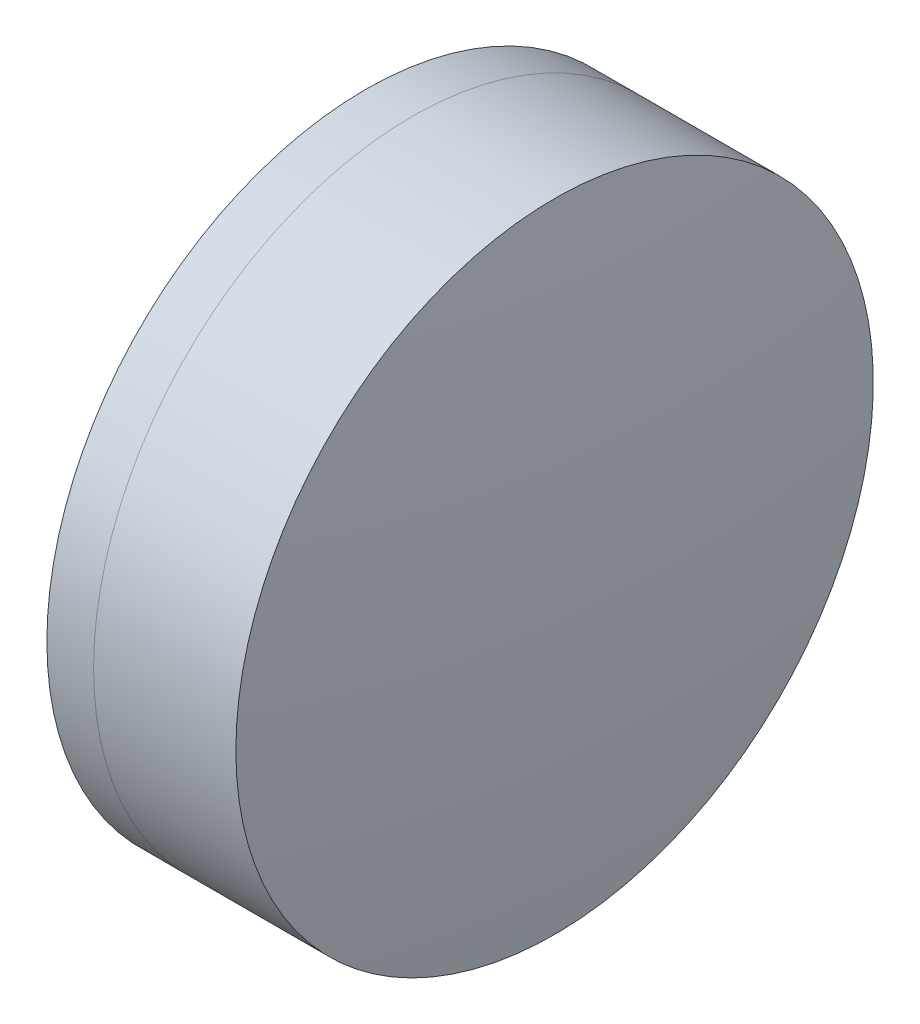
ISO-10303-21;
HEADER;
FILE_DESCRIPTION(('STEP AP214'),'2;1');
FILE_NAME('part.step','',(''),(''),'','','');
FILE_SCHEMA(('AUTOMOTIVE_DESIGN { 1 0 10303 214 1 1 1 1 }'));
ENDSEC;
DATA;
#1=APPLICATION_CONTEXT('core data for automotive mechanical design processes');
#2=APPLICATION_PROTOCOL_DEFINITION('international standard','automotive_design',2000,#1);
#3=PRODUCT_CONTEXT('',#1,'mechanical');
#4=PRODUCT('Part','Part','',(#3));
#5=PRODUCT_RELATED_PRODUCT_CATEGORY('part','',(#4));
#6=PRODUCT_DEFINITION_FORMATION('','',#4);
#7=PRODUCT_DEFINITION_CONTEXT('part definition',#1,'design');
#8=PRODUCT_DEFINITION('design','',#6,#7);
#9=PRODUCT_DEFINITION_SHAPE('','',#8);
#10=(LENGTH_UNIT() NAMED_UNIT(*) SI_UNIT(.MILLI.,.METRE.));
#11=(NAMED_UNIT(*) PLANE_ANGLE_UNIT() SI_UNIT($,.RADIAN.));
#12=(NAMED_UNIT(*) SI_UNIT($,.STERADIAN.) SOLID_ANGLE_UNIT());
#13=UNCERTAINTY_MEASURE_WITH_UNIT(LENGTH_MEASURE(1.E-05),#10,'distance_accuracy_value','');
#14=(GEOMETRIC_REPRESENTATION_CONTEXT(3) GLOBAL_UNCERTAINTY_ASSIGNED_CONTEXT((#13)) GLOBAL_UNIT_ASSIGNED_CONTEXT((#10,
#11,#12)) REPRESENTATION_CONTEXT('',''));
#15=CARTESIAN_POINT('',(0.,0.,0.));
#16=DIRECTION('',(0.,0.,1.));
#17=DIRECTION('',(1.,0.,0.));
#18=AXIS2_PLACEMENT_3D('',#15,#16,#17);
#19=CARTESIAN_POINT('',(264.478986554565,0.,0.));
#20=DIRECTION('',(-1.,0.,0.));
#21=DIRECTION('',(0.,0.,1.));
#22=AXIS2_PLACEMENT_3D('',#19,#20,#21);
#23=SPHERICAL_SURFACE('',#22,18.62);
#24=CARTESIAN_POINT('',(278.095682188969,0.,0.));
#25=DIRECTION('',(-1.,0.,0.));
#26=DIRECTION('',(0.,0.,1.));
#27=AXIS2_PLACEMENT_3D('',#24,#25,#26);
#28=CIRCLE('',#27,12.7);
#29=CARTESIAN_POINT('',(278.095682188969,0.,12.7));
#30=VERTEX_POINT('',#29);
#31=EDGE_CURVE('E11',#30,#30,#28,.T.);
#32=ORIENTED_EDGE('',*,*,#31,.T.);
#33=EDGE_LOOP('',(#32));
#34=FACE_BOUND('',#33,.T.);
#35=ADVANCED_FACE('F43',(#34),#23,.F.);
#36=CARTESIAN_POINT('',(-0.551919992657797,0.,0.));
#37=DIRECTION('',(-1.,0.,0.));
#38=DIRECTION('',(0.,0.,1.));
#39=AXIS2_PLACEMENT_3D('',#36,#37,#38);
#40=CYLINDRICAL_SURFACE('',#39,12.7);
#41=CARTESIAN_POINT('',(283.766338757952,0.,0.));
#42=DIRECTION('',(-1.,0.,0.));
#43=DIRECTION('',(0.,0.,1.));
#44=AXIS2_PLACEMENT_3D('',#41,#42,#43);
#45=CIRCLE('',#44,12.7);
#46=CARTESIAN_POINT('',(283.766338757952,0.,12.7));
#47=VERTEX_POINT('',#46);
#48=EDGE_CURVE('E49',#47,#47,#45,.T.);
#49=ORIENTED_EDGE('',*,*,#48,.T.);
#50=EDGE_LOOP('',(#49));
#51=FACE_BOUND('',#50,.T.);
#52=ORIENTED_EDGE('',*,*,#31,.F.);
#53=EDGE_LOOP('',(#52));
#54=FACE_BOUND('',#53,.T.);
#55=ADVANCED_FACE('F55',(#51,#54),#40,.T.);
#56=CARTESIAN_POINT('',(187.328986554565,0.,0.));
#57=DIRECTION('',(-1.,0.,0.));
#58=DIRECTION('',(0.,0.,1.));
#59=AXIS2_PLACEMENT_3D('',#56,#57,#58);
#60=SPHERICAL_SURFACE('',#59,97.2700000000001);
#61=ORIENTED_EDGE('',*,*,#48,.F.);
#62=EDGE_LOOP('',(#61));
#63=FACE_BOUND('',#62,.T.);
#64=ADVANCED_FACE('F58',(#63),#60,.T.);
#65=CLOSED_SHELL('',(#35,#55,#64));
#66=MANIFOLD_SOLID_BREP('B2',#65);
#67=CARTESIAN_POINT('',(296.588986554565,0.,0.));
#68=DIRECTION('',(-1.,0.,0.));
#69=DIRECTION('',(0.,0.,-1.));
#70=AXIS2_PLACEMENT_3D('',#67,#68,#69);
#71=SPHERICAL_SURFACE('',#70,23.99);
#72=CARTESIAN_POINT('',(276.236342991627,0.,0.));
#73=DIRECTION('',(-1.,0.,0.));
#74=DIRECTION('',(0.,0.,1.));
#75=AXIS2_PLACEMENT_3D('',#72,#73,#74);
#76=CIRCLE('',#75,12.7);
#77=CARTESIAN_POINT('',(276.236342991627,0.,12.7));
#78=VERTEX_POINT('',#77);
#79=EDGE_CURVE('E42',#78,#78,#76,.T.);
#80=ORIENTED_EDGE('',*,*,#79,.T.);
#81=EDGE_LOOP('',(#80));
#82=FACE_BOUND('',#81,.T.);
#83=ADVANCED_FACE('F84',(#82),#71,.T.);
#84=CARTESIAN_POINT('',(124.523309526045,0.,0.));
#85=DIRECTION('',(-1.,0.,0.));
#86=DIRECTION('',(0.,0.,1.));
#87=AXIS2_PLACEMENT_3D('',#84,#85,#86);
#88=CYLINDRICAL_SURFACE('',#87,12.7);
#89=CARTESIAN_POINT('',(278.095682188969,0.,0.));
#90=DIRECTION('',(-1.,0.,0.));
#91=DIRECTION('',(0.,0.,1.));
#92=AXIS2_PLACEMENT_3D('',#89,#90,#91);
#93=CIRCLE('',#92,12.7);
#94=CARTESIAN_POINT('',(278.095682188969,0.,12.7));
#95=VERTEX_POINT('',#94);
#96=EDGE_CURVE('E90',#95,#95,#93,.T.);
#97=ORIENTED_EDGE('',*,*,#96,.T.);
#98=EDGE_LOOP('',(#97));
#99=FACE_BOUND('',#98,.T.);
#100=ORIENTED_EDGE('',*,*,#79,.F.);
#101=EDGE_LOOP('',(#100));
#102=FACE_BOUND('',#101,.T.);
#103=ADVANCED_FACE('F96',(#99,#102),#88,.T.);
#104=CARTESIAN_POINT('',(264.478986554565,0.,0.));
#105=DIRECTION('',(-1.,0.,0.));
#106=DIRECTION('',(0.,0.,1.));
#107=AXIS2_PLACEMENT_3D('',#104,#105,#106);
#108=SPHERICAL_SURFACE('',#107,18.62);
#109=ORIENTED_EDGE('',*,*,#96,.F.);
#110=EDGE_LOOP('',(#109));
#111=FACE_BOUND('',#110,.T.);
#112=ADVANCED_FACE('F99',(#111),#108,.T.);
#113=CLOSED_SHELL('',(#83,#103,#112));
#114=MANIFOLD_SOLID_BREP('B6',#113);
#115=ADVANCED_BREP_SHAPE_REPRESENTATION('',(#18,#66,#114),#14);
#116=SHAPE_DEFINITION_REPRESENTATION(#9,#115);
ENDSEC;
END-ISO-10303-21;
